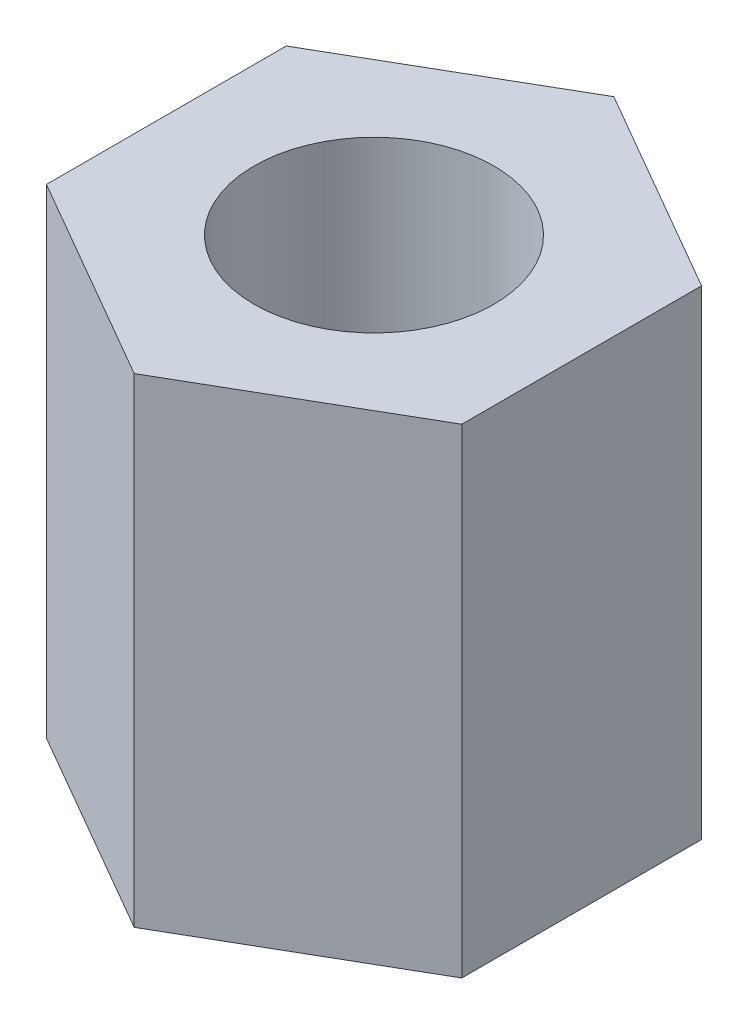
ISO-10303-21;
HEADER;
FILE_DESCRIPTION(('STEP AP214'),'2;1');
FILE_NAME('part.step','',(''),(''),'','','');
FILE_SCHEMA(('AUTOMOTIVE_DESIGN { 1 0 10303 214 1 1 1 1 }'));
ENDSEC;
DATA;
#1=APPLICATION_CONTEXT('core data for automotive mechanical design processes');
#2=APPLICATION_PROTOCOL_DEFINITION('international standard','automotive_design',2000,#1);
#3=PRODUCT_CONTEXT('',#1,'mechanical');
#4=PRODUCT('Part','Part','',(#3));
#5=PRODUCT_RELATED_PRODUCT_CATEGORY('part','',(#4));
#6=PRODUCT_DEFINITION_FORMATION('','',#4);
#7=PRODUCT_DEFINITION_CONTEXT('part definition',#1,'design');
#8=PRODUCT_DEFINITION('design','',#6,#7);
#9=PRODUCT_DEFINITION_SHAPE('','',#8);
#10=(LENGTH_UNIT() NAMED_UNIT(*) SI_UNIT(.MILLI.,.METRE.));
#11=(NAMED_UNIT(*) PLANE_ANGLE_UNIT() SI_UNIT($,.RADIAN.));
#12=(NAMED_UNIT(*) SI_UNIT($,.STERADIAN.) SOLID_ANGLE_UNIT());
#13=UNCERTAINTY_MEASURE_WITH_UNIT(LENGTH_MEASURE(1.E-05),#10,'distance_accuracy_value','');
#14=(GEOMETRIC_REPRESENTATION_CONTEXT(3) GLOBAL_UNCERTAINTY_ASSIGNED_CONTEXT((#13)) GLOBAL_UNIT_ASSIGNED_CONTEXT((#10,
#11,#12)) REPRESENTATION_CONTEXT('',''));
#15=CARTESIAN_POINT('',(0.,0.,0.));
#16=DIRECTION('',(0.,0.,1.));
#17=DIRECTION('',(1.,0.,0.));
#18=AXIS2_PLACEMENT_3D('',#15,#16,#17);
#19=CARTESIAN_POINT('',(0.,10.,-5.));
#20=DIRECTION('',(0.,1.,0.));
#21=DIRECTION('',(0.,0.,1.));
#22=AXIS2_PLACEMENT_3D('',#19,#20,#21);
#23=PLANE('',#22);
#24=DIRECTION('',(-0.866025403784439,0.,-0.5));
#25=VECTOR('',#24,1.);
#26=CARTESIAN_POINT('',(4.33012701892219,10.,-2.5));
#27=LINE('',#26,#25);
#28=CARTESIAN_POINT('',(4.33012701892219,10.,-2.5));
#29=VERTEX_POINT('',#28);
#30=CARTESIAN_POINT('',(0.,10.,-5.));
#31=VERTEX_POINT('',#30);
#32=EDGE_CURVE('E127',#29,#31,#27,.T.);
#33=ORIENTED_EDGE('',*,*,#32,.T.);
#34=DIRECTION('',(-0.866025403784439,0.,0.5));
#35=VECTOR('',#34,1.);
#36=CARTESIAN_POINT('',(0.,10.,-5.));
#37=LINE('',#36,#35);
#38=CARTESIAN_POINT('',(-4.33012701892219,10.,-2.5));
#39=VERTEX_POINT('',#38);
#40=EDGE_CURVE('E85',#31,#39,#37,.T.);
#41=ORIENTED_EDGE('',*,*,#40,.T.);
#42=DIRECTION('',(0.,0.,1.));
#43=VECTOR('',#42,1.);
#44=CARTESIAN_POINT('',(-4.33012701892219,10.,-2.5));
#45=LINE('',#44,#43);
#46=CARTESIAN_POINT('',(-4.33012701892219,10.,2.5));
#47=VERTEX_POINT('',#46);
#48=EDGE_CURVE('E98',#39,#47,#45,.T.);
#49=ORIENTED_EDGE('',*,*,#48,.T.);
#50=DIRECTION('',(0.866025403784439,0.,0.5));
#51=VECTOR('',#50,1.);
#52=CARTESIAN_POINT('',(-4.33012701892219,10.,2.5));
#53=LINE('',#52,#51);
#54=CARTESIAN_POINT('',(0.,10.,5.));
#55=VERTEX_POINT('',#54);
#56=EDGE_CURVE('E92',#47,#55,#53,.T.);
#57=ORIENTED_EDGE('',*,*,#56,.T.);
#58=DIRECTION('',(0.866025403784439,0.,-0.5));
#59=VECTOR('',#58,1.);
#60=CARTESIAN_POINT('',(0.,10.,5.));
#61=LINE('',#60,#59);
#62=CARTESIAN_POINT('',(4.33012701892219,10.,2.5));
#63=VERTEX_POINT('',#62);
#64=EDGE_CURVE('E96',#55,#63,#61,.T.);
#65=ORIENTED_EDGE('',*,*,#64,.T.);
#66=DIRECTION('',(0.,0.,-1.));
#67=VECTOR('',#66,1.);
#68=CARTESIAN_POINT('',(4.33012701892219,10.,2.5));
#69=LINE('',#68,#67);
#70=EDGE_CURVE('E48',#63,#29,#69,.T.);
#71=ORIENTED_EDGE('',*,*,#70,.T.);
#72=EDGE_LOOP('',(#33,#41,#49,#57,#65,#71));
#73=FACE_BOUND('',#72,.T.);
#74=CARTESIAN_POINT('',(0.,10.,0.));
#75=DIRECTION('',(0.,1.,0.));
#76=DIRECTION('',(0.,0.,1.));
#77=AXIS2_PLACEMENT_3D('',#74,#75,#76);
#78=CIRCLE('',#77,2.5);
#79=CARTESIAN_POINT('',(0.,10.,2.5));
#80=VERTEX_POINT('',#79);
#81=EDGE_CURVE('E120',#80,#80,#78,.T.);
#82=ORIENTED_EDGE('',*,*,#81,.F.);
#83=EDGE_LOOP('',(#82));
#84=FACE_BOUND('',#83,.T.);
#85=ADVANCED_FACE('F31',(#73,#84),#23,.T.);
#86=CARTESIAN_POINT('',(0.,0.,-5.));
#87=DIRECTION('',(0.,1.,0.));
#88=DIRECTION('',(0.,0.,1.));
#89=AXIS2_PLACEMENT_3D('',#86,#87,#88);
#90=PLANE('',#89);
#91=DIRECTION('',(-0.866025403784439,0.,-0.5));
#92=VECTOR('',#91,1.);
#93=CARTESIAN_POINT('',(4.33012701892219,0.,-2.5));
#94=LINE('',#93,#92);
#95=CARTESIAN_POINT('',(4.33012701892219,0.,-2.5));
#96=VERTEX_POINT('',#95);
#97=CARTESIAN_POINT('',(0.,0.,-5.));
#98=VERTEX_POINT('',#97);
#99=EDGE_CURVE('E116',#96,#98,#94,.T.);
#100=ORIENTED_EDGE('',*,*,#99,.F.);
#101=DIRECTION('',(0.,0.,-1.));
#102=VECTOR('',#101,1.);
#103=CARTESIAN_POINT('',(4.33012701892219,0.,2.5));
#104=LINE('',#103,#102);
#105=CARTESIAN_POINT('',(4.33012701892219,0.,2.5));
#106=VERTEX_POINT('',#105);
#107=EDGE_CURVE('E77',#106,#96,#104,.T.);
#108=ORIENTED_EDGE('',*,*,#107,.F.);
#109=DIRECTION('',(0.866025403784439,0.,-0.5));
#110=VECTOR('',#109,1.);
#111=CARTESIAN_POINT('',(0.,0.,5.));
#112=LINE('',#111,#110);
#113=CARTESIAN_POINT('',(0.,0.,5.));
#114=VERTEX_POINT('',#113);
#115=EDGE_CURVE('E71',#114,#106,#112,.T.);
#116=ORIENTED_EDGE('',*,*,#115,.F.);
#117=DIRECTION('',(0.866025403784439,0.,0.5));
#118=VECTOR('',#117,1.);
#119=CARTESIAN_POINT('',(-4.33012701892219,0.,2.5));
#120=LINE('',#119,#118);
#121=CARTESIAN_POINT('',(-4.33012701892219,0.,2.5));
#122=VERTEX_POINT('',#121);
#123=EDGE_CURVE('E106',#122,#114,#120,.T.);
#124=ORIENTED_EDGE('',*,*,#123,.F.);
#125=DIRECTION('',(0.,0.,1.));
#126=VECTOR('',#125,1.);
#127=CARTESIAN_POINT('',(-4.33012701892219,0.,-2.5));
#128=LINE('',#127,#126);
#129=CARTESIAN_POINT('',(-4.33012701892219,0.,-2.5));
#130=VERTEX_POINT('',#129);
#131=EDGE_CURVE('E122',#130,#122,#128,.T.);
#132=ORIENTED_EDGE('',*,*,#131,.F.);
#133=DIRECTION('',(-0.866025403784439,0.,0.5));
#134=VECTOR('',#133,1.);
#135=CARTESIAN_POINT('',(0.,0.,-5.));
#136=LINE('',#135,#134);
#137=EDGE_CURVE('E119',#98,#130,#136,.T.);
#138=ORIENTED_EDGE('',*,*,#137,.F.);
#139=EDGE_LOOP('',(#100,#108,#116,#124,#132,#138));
#140=FACE_BOUND('',#139,.T.);
#141=CARTESIAN_POINT('',(0.,0.,0.));
#142=DIRECTION('',(0.,1.,0.));
#143=DIRECTION('',(0.,0.,1.));
#144=AXIS2_PLACEMENT_3D('',#141,#142,#143);
#145=CIRCLE('',#144,2.5);
#146=CARTESIAN_POINT('',(0.,0.,2.5));
#147=VERTEX_POINT('',#146);
#148=EDGE_CURVE('E220',#147,#147,#145,.T.);
#149=ORIENTED_EDGE('',*,*,#148,.T.);
#150=EDGE_LOOP('',(#149));
#151=FACE_BOUND('',#150,.T.);
#152=ADVANCED_FACE('F136',(#140,#151),#90,.F.);
#153=CARTESIAN_POINT('',(4.33012701892219,10.,-2.5));
#154=DIRECTION('',(-0.5,0.,0.866025403784439));
#155=DIRECTION('',(0.866025403784439,0.,0.5));
#156=AXIS2_PLACEMENT_3D('',#153,#154,#155);
#157=PLANE('',#156);
#158=ORIENTED_EDGE('',*,*,#99,.T.);
#159=DIRECTION('',(0.,-1.,0.));
#160=VECTOR('',#159,1.);
#161=CARTESIAN_POINT('',(0.,10.,-5.));
#162=LINE('',#161,#160);
#163=EDGE_CURVE('E11',#31,#98,#162,.T.);
#164=ORIENTED_EDGE('',*,*,#163,.F.);
#165=ORIENTED_EDGE('',*,*,#32,.F.);
#166=DIRECTION('',(0.,-1.,0.));
#167=VECTOR('',#166,1.);
#168=CARTESIAN_POINT('',(4.33012701892219,10.,-2.5));
#169=LINE('',#168,#167);
#170=EDGE_CURVE('E112',#29,#96,#169,.T.);
#171=ORIENTED_EDGE('',*,*,#170,.T.);
#172=EDGE_LOOP('',(#158,#164,#165,#171));
#173=FACE_BOUND('',#172,.T.);
#174=ADVANCED_FACE('F33',(#173),#157,.F.);
#175=CARTESIAN_POINT('',(0.,10.,-5.));
#176=DIRECTION('',(0.5,0.,0.866025403784439));
#177=DIRECTION('',(0.866025403784439,0.,-0.5));
#178=AXIS2_PLACEMENT_3D('',#175,#176,#177);
#179=PLANE('',#178);
#180=ORIENTED_EDGE('',*,*,#137,.T.);
#181=DIRECTION('',(0.,-1.,0.));
#182=VECTOR('',#181,1.);
#183=CARTESIAN_POINT('',(-4.33012701892219,10.,-2.5));
#184=LINE('',#183,#182);
#185=EDGE_CURVE('E40',#39,#130,#184,.T.);
#186=ORIENTED_EDGE('',*,*,#185,.F.);
#187=ORIENTED_EDGE('',*,*,#40,.F.);
#188=ORIENTED_EDGE('',*,*,#163,.T.);
#189=EDGE_LOOP('',(#180,#186,#187,#188));
#190=FACE_BOUND('',#189,.T.);
#191=ADVANCED_FACE('F161',(#190),#179,.F.);
#192=CARTESIAN_POINT('',(-4.33012701892219,10.,-2.5));
#193=DIRECTION('',(1.,0.,0.));
#194=DIRECTION('',(0.,0.,-1.));
#195=AXIS2_PLACEMENT_3D('',#192,#193,#194);
#196=PLANE('',#195);
#197=ORIENTED_EDGE('',*,*,#131,.T.);
#198=DIRECTION('',(0.,-1.,0.));
#199=VECTOR('',#198,1.);
#200=CARTESIAN_POINT('',(-4.33012701892219,10.,2.5));
#201=LINE('',#200,#199);
#202=EDGE_CURVE('E107',#47,#122,#201,.T.);
#203=ORIENTED_EDGE('',*,*,#202,.F.);
#204=ORIENTED_EDGE('',*,*,#48,.F.);
#205=ORIENTED_EDGE('',*,*,#185,.T.);
#206=EDGE_LOOP('',(#197,#203,#204,#205));
#207=FACE_BOUND('',#206,.T.);
#208=ADVANCED_FACE('F133',(#207),#196,.F.);
#209=CARTESIAN_POINT('',(-4.33012701892219,10.,2.5));
#210=DIRECTION('',(0.5,0.,-0.866025403784439));
#211=DIRECTION('',(-0.866025403784439,0.,-0.5));
#212=AXIS2_PLACEMENT_3D('',#209,#210,#211);
#213=PLANE('',#212);
#214=ORIENTED_EDGE('',*,*,#123,.T.);
#215=DIRECTION('',(0.,-1.,0.));
#216=VECTOR('',#215,1.);
#217=CARTESIAN_POINT('',(0.,10.,5.));
#218=LINE('',#217,#216);
#219=EDGE_CURVE('E103',#55,#114,#218,.T.);
#220=ORIENTED_EDGE('',*,*,#219,.F.);
#221=ORIENTED_EDGE('',*,*,#56,.F.);
#222=ORIENTED_EDGE('',*,*,#202,.T.);
#223=EDGE_LOOP('',(#214,#220,#221,#222));
#224=FACE_BOUND('',#223,.T.);
#225=ADVANCED_FACE('F104',(#224),#213,.F.);
#226=CARTESIAN_POINT('',(0.,10.,5.));
#227=DIRECTION('',(-0.5,0.,-0.866025403784439));
#228=DIRECTION('',(-0.866025403784439,0.,0.5));
#229=AXIS2_PLACEMENT_3D('',#226,#227,#228);
#230=PLANE('',#229);
#231=ORIENTED_EDGE('',*,*,#115,.T.);
#232=DIRECTION('',(0.,-1.,0.));
#233=VECTOR('',#232,1.);
#234=CARTESIAN_POINT('',(4.33012701892219,10.,2.5));
#235=LINE('',#234,#233);
#236=EDGE_CURVE('E108',#63,#106,#235,.T.);
#237=ORIENTED_EDGE('',*,*,#236,.F.);
#238=ORIENTED_EDGE('',*,*,#64,.F.);
#239=ORIENTED_EDGE('',*,*,#219,.T.);
#240=EDGE_LOOP('',(#231,#237,#238,#239));
#241=FACE_BOUND('',#240,.T.);
#242=ADVANCED_FACE('F110',(#241),#230,.F.);
#243=CARTESIAN_POINT('',(4.33012701892219,10.,2.5));
#244=DIRECTION('',(-1.,0.,0.));
#245=DIRECTION('',(0.,0.,1.));
#246=AXIS2_PLACEMENT_3D('',#243,#244,#245);
#247=PLANE('',#246);
#248=ORIENTED_EDGE('',*,*,#107,.T.);
#249=ORIENTED_EDGE('',*,*,#170,.F.);
#250=ORIENTED_EDGE('',*,*,#70,.F.);
#251=ORIENTED_EDGE('',*,*,#236,.T.);
#252=EDGE_LOOP('',(#248,#249,#250,#251));
#253=FACE_BOUND('',#252,.T.);
#254=ADVANCED_FACE('F141',(#253),#247,.F.);
#255=CARTESIAN_POINT('',(0.,10.,0.));
#256=DIRECTION('',(0.,-1.,0.));
#257=DIRECTION('',(0.,0.,-1.));
#258=AXIS2_PLACEMENT_3D('',#255,#256,#257);
#259=CYLINDRICAL_SURFACE('',#258,2.5);
#260=ORIENTED_EDGE('',*,*,#81,.T.);
#261=EDGE_LOOP('',(#260));
#262=FACE_BOUND('',#261,.T.);
#263=ORIENTED_EDGE('',*,*,#148,.F.);
#264=EDGE_LOOP('',(#263));
#265=FACE_BOUND('',#264,.T.);
#266=ADVANCED_FACE('F143',(#262,#265),#259,.F.);
#267=CLOSED_SHELL('',(#85,#152,#174,#191,#208,#225,#242,#254,#266));
#268=MANIFOLD_SOLID_BREP('B2',#267);
#269=ADVANCED_BREP_SHAPE_REPRESENTATION('',(#18,#268),#14);
#270=SHAPE_DEFINITION_REPRESENTATION(#9,#269);
ENDSEC;
END-ISO-10303-21;
